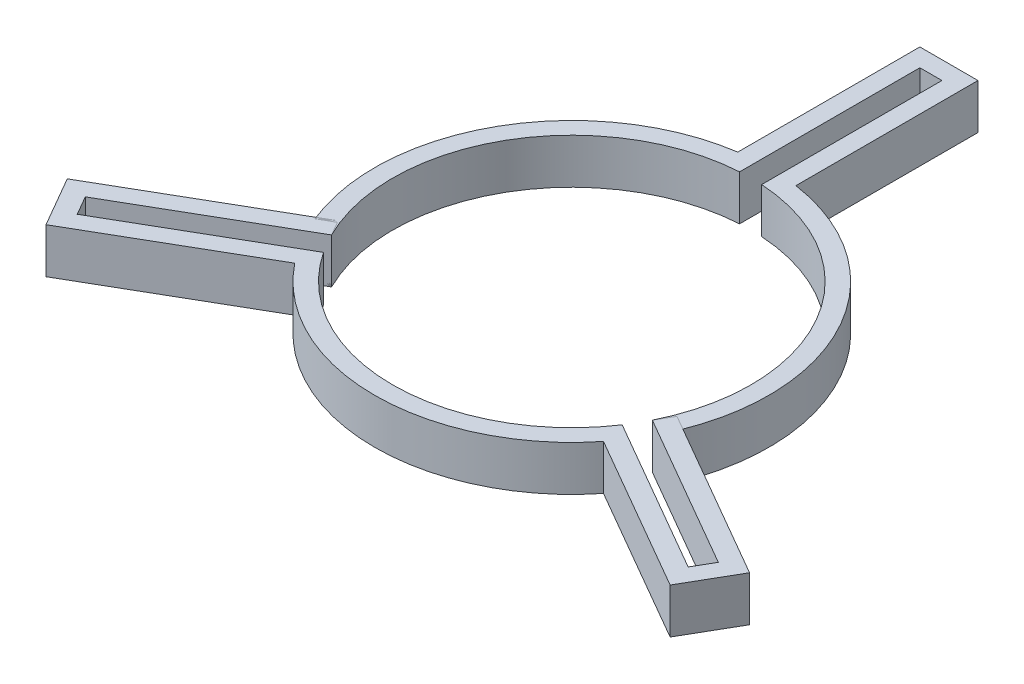
ISO-10303-21;
HEADER;
FILE_DESCRIPTION(('STEP AP214'),'2;1');
FILE_NAME('part.step','',(''),(''),'','','');
FILE_SCHEMA(('AUTOMOTIVE_DESIGN { 1 0 10303 214 1 1 1 1 }'));
ENDSEC;
DATA;
#1=APPLICATION_CONTEXT('core data for automotive mechanical design processes');
#2=APPLICATION_PROTOCOL_DEFINITION('international standard','automotive_design',2000,#1);
#3=PRODUCT_CONTEXT('',#1,'mechanical');
#4=PRODUCT('Part','Part','',(#3));
#5=PRODUCT_RELATED_PRODUCT_CATEGORY('part','',(#4));
#6=PRODUCT_DEFINITION_FORMATION('','',#4);
#7=PRODUCT_DEFINITION_CONTEXT('part definition',#1,'design');
#8=PRODUCT_DEFINITION('design','',#6,#7);
#9=PRODUCT_DEFINITION_SHAPE('','',#8);
#10=(LENGTH_UNIT() NAMED_UNIT(*) SI_UNIT(.MILLI.,.METRE.));
#11=(NAMED_UNIT(*) PLANE_ANGLE_UNIT() SI_UNIT($,.RADIAN.));
#12=(NAMED_UNIT(*) SI_UNIT($,.STERADIAN.) SOLID_ANGLE_UNIT());
#13=UNCERTAINTY_MEASURE_WITH_UNIT(LENGTH_MEASURE(1.E-05),#10,'distance_accuracy_value','');
#14=(GEOMETRIC_REPRESENTATION_CONTEXT(3) GLOBAL_UNCERTAINTY_ASSIGNED_CONTEXT((#13)) GLOBAL_UNIT_ASSIGNED_CONTEXT((#10,
#11,#12)) REPRESENTATION_CONTEXT('',''));
#15=CARTESIAN_POINT('',(0.,0.,0.));
#16=DIRECTION('',(0.,0.,1.));
#17=DIRECTION('',(1.,0.,0.));
#18=AXIS2_PLACEMENT_3D('',#15,#16,#17);
#19=CARTESIAN_POINT('',(0.,10.,0.));
#20=DIRECTION('',(0.,-1.,0.));
#21=DIRECTION('',(0.,0.,-1.));
#22=AXIS2_PLACEMENT_3D('',#19,#20,#21);
#23=CYLINDRICAL_SURFACE('',#22,43.75);
#24=CARTESIAN_POINT('',(0.,10.,0.));
#25=DIRECTION('',(0.,1.,0.));
#26=DIRECTION('',(0.,0.,1.));
#27=AXIS2_PLACEMENT_3D('',#24,#25,#26);
#28=CIRCLE('',#27,43.75);
#29=CARTESIAN_POINT('',(39.054155422769,10.,19.7189108272795));
#30=VERTEX_POINT('',#29);
#31=CARTESIAN_POINT('',(6.45,10.,-43.2719308559255));
#32=VERTEX_POINT('',#31);
#33=EDGE_CURVE('E185',#30,#32,#28,.T.);
#34=ORIENTED_EDGE('',*,*,#33,.F.);
#35=DIRECTION('',(0.,-1.,0.));
#36=VECTOR('',#35,1.);
#37=CARTESIAN_POINT('',(39.054155422769,10.,19.7189108272795));
#38=LINE('',#37,#36);
#39=CARTESIAN_POINT('',(39.054155422769,0.,19.7189108272795));
#40=VERTEX_POINT('',#39);
#41=EDGE_CURVE('E83',#30,#40,#38,.T.);
#42=ORIENTED_EDGE('',*,*,#41,.T.);
#43=CARTESIAN_POINT('',(0.,0.,0.));
#44=DIRECTION('',(0.,1.,0.));
#45=DIRECTION('',(0.,0.,1.));
#46=AXIS2_PLACEMENT_3D('',#43,#44,#45);
#47=CIRCLE('',#46,43.75);
#48=CARTESIAN_POINT('',(6.45,0.,-43.2719308559255));
#49=VERTEX_POINT('',#48);
#50=EDGE_CURVE('E176',#40,#49,#47,.T.);
#51=ORIENTED_EDGE('',*,*,#50,.T.);
#52=DIRECTION('',(0.,-1.,0.));
#53=VECTOR('',#52,1.);
#54=CARTESIAN_POINT('',(6.45,10.,-43.2719308559255));
#55=LINE('',#54,#53);
#56=EDGE_CURVE('E198',#49,#32,#55,.F.);
#57=ORIENTED_EDGE('',*,*,#56,.T.);
#58=EDGE_LOOP('',(#34,#42,#51,#57));
#59=FACE_BOUND('',#58,.T.);
#60=ADVANCED_FACE('F43',(#59),#23,.T.);
#61=CARTESIAN_POINT('',(0.,10.,0.));
#62=DIRECTION('',(0.,-1.,0.));
#63=DIRECTION('',(0.,0.,-1.));
#64=AXIS2_PLACEMENT_3D('',#61,#62,#63);
#65=CYLINDRICAL_SURFACE('',#64,39.75);
#66=DIRECTION('',(0.,-1.,0.));
#67=VECTOR('',#66,1.);
#68=CARTESIAN_POINT('',(35.5840599405748,10.,17.715450266521));
#69=LINE('',#68,#67);
#70=CARTESIAN_POINT('',(35.5840599405748,10.,17.715450266521));
#71=VERTEX_POINT('',#70);
#72=CARTESIAN_POINT('',(35.5840599405748,0.,17.715450266521));
#73=VERTEX_POINT('',#72);
#74=EDGE_CURVE('E178',#71,#73,#69,.T.);
#75=ORIENTED_EDGE('',*,*,#74,.F.);
#76=CARTESIAN_POINT('',(0.,10.,0.));
#77=DIRECTION('',(0.,1.,0.));
#78=DIRECTION('',(0.,0.,1.));
#79=AXIS2_PLACEMENT_3D('',#76,#77,#78);
#80=CIRCLE('',#79,39.75);
#81=CARTESIAN_POINT('',(2.45,10.,-39.6744250115865));
#82=VERTEX_POINT('',#81);
#83=EDGE_CURVE('E190',#71,#82,#80,.T.);
#84=ORIENTED_EDGE('',*,*,#83,.T.);
#85=DIRECTION('',(0.,-1.,0.));
#86=VECTOR('',#85,1.);
#87=CARTESIAN_POINT('',(2.45,10.,-39.6744250115865));
#88=LINE('',#87,#86);
#89=CARTESIAN_POINT('',(2.45,0.,-39.6744250115865));
#90=VERTEX_POINT('',#89);
#91=EDGE_CURVE('E189',#90,#82,#88,.F.);
#92=ORIENTED_EDGE('',*,*,#91,.F.);
#93=CARTESIAN_POINT('',(0.,0.,0.));
#94=DIRECTION('',(0.,1.,0.));
#95=DIRECTION('',(0.,0.,1.));
#96=AXIS2_PLACEMENT_3D('',#93,#94,#95);
#97=CIRCLE('',#96,39.75);
#98=EDGE_CURVE('E144',#73,#90,#97,.T.);
#99=ORIENTED_EDGE('',*,*,#98,.F.);
#100=EDGE_LOOP('',(#75,#84,#92,#99));
#101=FACE_BOUND('',#100,.T.);
#102=ADVANCED_FACE('F250',(#101),#65,.F.);
#103=CARTESIAN_POINT('',(0.,10.,0.));
#104=DIRECTION('',(0.,1.,0.));
#105=DIRECTION('',(0.,0.,1.));
#106=AXIS2_PLACEMENT_3D('',#103,#104,#105);
#107=PLANE('',#106);
#108=DIRECTION('',(-0.866025403784436,0.,0.500000000000004));
#109=VECTOR('',#108,1.);
#110=CARTESIAN_POINT('',(-44.628813186876,10.,22.9374409880275));
#111=LINE('',#110,#109);
#112=CARTESIAN_POINT('',(-35.5840599405745,10.,17.7154502665215));
#113=VERTEX_POINT('',#112);
#114=CARTESIAN_POINT('',(-39.0541554227687,10.,19.7189108272801));
#115=VERTEX_POINT('',#114);
#116=EDGE_CURVE('E12',#113,#115,#111,.T.);
#117=ORIENTED_EDGE('',*,*,#116,.F.);
#118=CARTESIAN_POINT('',(-2.45000000000001,10.,-39.6744250115865));
#119=VERTEX_POINT('',#118);
#120=EDGE_CURVE('E187',#119,#113,#80,.T.);
#121=ORIENTED_EDGE('',*,*,#120,.F.);
#122=DIRECTION('',(0.,0.,1.));
#123=VECTOR('',#122,1.);
#124=CARTESIAN_POINT('',(-2.45000000000001,10.,-37.8382708200077));
#125=LINE('',#124,#123);
#126=CARTESIAN_POINT('',(-2.45,10.,-79.6744250115865));
#127=VERTEX_POINT('',#126);
#128=EDGE_CURVE('E211',#127,#119,#125,.T.);
#129=ORIENTED_EDGE('',*,*,#128,.F.);
#130=DIRECTION('',(1.,0.,0.));
#131=VECTOR('',#130,1.);
#132=CARTESIAN_POINT('',(2.45,10.,-79.6744250115865));
#133=LINE('',#132,#131);
#134=CARTESIAN_POINT('',(2.45,10.,-79.6744250115865));
#135=VERTEX_POINT('',#134);
#136=EDGE_CURVE('E197',#127,#135,#133,.T.);
#137=ORIENTED_EDGE('',*,*,#136,.T.);
#138=DIRECTION('',(0.,0.,-1.));
#139=VECTOR('',#138,1.);
#140=CARTESIAN_POINT('',(2.44999999999999,10.,-50.1184064545983));
#141=LINE('',#140,#139);
#142=EDGE_CURVE('E154',#82,#135,#141,.T.);
#143=ORIENTED_EDGE('',*,*,#142,.F.);
#144=ORIENTED_EDGE('',*,*,#83,.F.);
#145=DIRECTION('',(-0.866025403784443,0.,-0.499999999999992));
#146=VECTOR('',#145,1.);
#147=CARTESIAN_POINT('',(33.9939037654022,10.,16.7973731707316));
#148=LINE('',#147,#146);
#149=EDGE_CURVE('E158',#30,#71,#148,.T.);
#150=ORIENTED_EDGE('',*,*,#149,.F.);
#151=ORIENTED_EDGE('',*,*,#33,.T.);
#152=DIRECTION('',(0.,0.,-1.));
#153=VECTOR('',#152,1.);
#154=CARTESIAN_POINT('',(6.44999999999999,10.,-83.6744250115865));
#155=LINE('',#154,#153);
#156=CARTESIAN_POINT('',(6.44999999999999,10.,-83.6744250115865));
#157=VERTEX_POINT('',#156);
#158=EDGE_CURVE('E225',#32,#157,#155,.T.);
#159=ORIENTED_EDGE('',*,*,#158,.T.);
#160=DIRECTION('',(-1.,0.,0.));
#161=VECTOR('',#160,1.);
#162=CARTESIAN_POINT('',(-6.45000000000001,10.,-83.6744250115865));
#163=LINE('',#162,#161);
#164=CARTESIAN_POINT('',(-6.45000000000001,10.,-83.6744250115865));
#165=VERTEX_POINT('',#164);
#166=EDGE_CURVE('E222',#157,#165,#163,.T.);
#167=ORIENTED_EDGE('',*,*,#166,.T.);
#168=DIRECTION('',(0.,0.,1.));
#169=VECTOR('',#168,1.);
#170=CARTESIAN_POINT('',(-6.45000000000001,10.,-39.6744250115865));
#171=LINE('',#170,#169);
#172=CARTESIAN_POINT('',(-6.45000000000001,10.,-43.2719308559255));
#173=VERTEX_POINT('',#172);
#174=EDGE_CURVE('E184',#165,#173,#171,.T.);
#175=ORIENTED_EDGE('',*,*,#174,.T.);
#176=EDGE_CURVE('E181',#173,#115,#28,.T.);
#177=ORIENTED_EDGE('',*,*,#176,.T.);
#178=EDGE_LOOP('',(#117,#121,#129,#137,#143,#144,#150,#151,#159,#167,#175,#177));
#179=FACE_BOUND('',#178,.T.);
#180=ADVANCED_FACE('F45',(#179),#107,.T.);
#181=CARTESIAN_POINT('',(0.,0.,0.));
#182=DIRECTION('',(0.,1.,0.));
#183=DIRECTION('',(0.,0.,1.));
#184=AXIS2_PLACEMENT_3D('',#181,#182,#183);
#185=PLANE('',#184);
#186=CARTESIAN_POINT('',(-2.45000000000001,0.,-39.6744250115865));
#187=VERTEX_POINT('',#186);
#188=CARTESIAN_POINT('',(-35.5840599405745,0.,17.7154502665215));
#189=VERTEX_POINT('',#188);
#190=EDGE_CURVE('E47',#187,#189,#97,.T.);
#191=ORIENTED_EDGE('',*,*,#190,.T.);
#192=DIRECTION('',(-0.866025403784436,0.,0.500000000000004));
#193=VECTOR('',#192,1.);
#194=CARTESIAN_POINT('',(-44.628813186876,0.,22.9374409880275));
#195=LINE('',#194,#193);
#196=CARTESIAN_POINT('',(-39.0541554227687,0.,19.7189108272801));
#197=VERTEX_POINT('',#196);
#198=EDGE_CURVE('E86',#189,#197,#195,.T.);
#199=ORIENTED_EDGE('',*,*,#198,.T.);
#200=CARTESIAN_POINT('',(-6.45000000000001,0.,-43.2719308559255));
#201=VERTEX_POINT('',#200);
#202=EDGE_CURVE('E174',#201,#197,#47,.T.);
#203=ORIENTED_EDGE('',*,*,#202,.F.);
#204=DIRECTION('',(0.,0.,1.));
#205=VECTOR('',#204,1.);
#206=CARTESIAN_POINT('',(-6.45000000000001,0.,-39.6744250115865));
#207=LINE('',#206,#205);
#208=CARTESIAN_POINT('',(-6.45000000000001,0.,-83.6744250115865));
#209=VERTEX_POINT('',#208);
#210=EDGE_CURVE('E216',#209,#201,#207,.T.);
#211=ORIENTED_EDGE('',*,*,#210,.F.);
#212=DIRECTION('',(-1.,0.,0.));
#213=VECTOR('',#212,1.);
#214=CARTESIAN_POINT('',(-6.45000000000001,0.,-83.6744250115865));
#215=LINE('',#214,#213);
#216=CARTESIAN_POINT('',(6.44999999999999,0.,-83.6744250115865));
#217=VERTEX_POINT('',#216);
#218=EDGE_CURVE('E166',#217,#209,#215,.T.);
#219=ORIENTED_EDGE('',*,*,#218,.F.);
#220=DIRECTION('',(0.,0.,-1.));
#221=VECTOR('',#220,1.);
#222=CARTESIAN_POINT('',(6.44999999999999,0.,-83.6744250115865));
#223=LINE('',#222,#221);
#224=EDGE_CURVE('E170',#49,#217,#223,.T.);
#225=ORIENTED_EDGE('',*,*,#224,.F.);
#226=ORIENTED_EDGE('',*,*,#50,.F.);
#227=DIRECTION('',(-0.866025403784443,0.,-0.499999999999992));
#228=VECTOR('',#227,1.);
#229=CARTESIAN_POINT('',(33.9939037654022,0.,16.7973731707316));
#230=LINE('',#229,#228);
#231=EDGE_CURVE('E80',#40,#73,#230,.T.);
#232=ORIENTED_EDGE('',*,*,#231,.T.);
#233=ORIENTED_EDGE('',*,*,#98,.T.);
#234=DIRECTION('',(0.,0.,-1.));
#235=VECTOR('',#234,1.);
#236=CARTESIAN_POINT('',(2.44999999999999,0.,-50.1184064545983));
#237=LINE('',#236,#235);
#238=CARTESIAN_POINT('',(2.45,0.,-79.6744250115865));
#239=VERTEX_POINT('',#238);
#240=EDGE_CURVE('E136',#90,#239,#237,.T.);
#241=ORIENTED_EDGE('',*,*,#240,.T.);
#242=DIRECTION('',(1.,0.,0.));
#243=VECTOR('',#242,1.);
#244=CARTESIAN_POINT('',(2.45,0.,-79.6744250115865));
#245=LINE('',#244,#243);
#246=CARTESIAN_POINT('',(-2.45,0.,-79.6744250115865));
#247=VERTEX_POINT('',#246);
#248=EDGE_CURVE('E142',#247,#239,#245,.T.);
#249=ORIENTED_EDGE('',*,*,#248,.F.);
#250=DIRECTION('',(0.,0.,1.));
#251=VECTOR('',#250,1.);
#252=CARTESIAN_POINT('',(-2.45000000000001,0.,-37.8382708200077));
#253=LINE('',#252,#251);
#254=EDGE_CURVE('E148',#247,#187,#253,.T.);
#255=ORIENTED_EDGE('',*,*,#254,.T.);
#256=EDGE_LOOP('',(#191,#199,#203,#211,#219,#225,#226,#232,#233,#241,#249,#255));
#257=FACE_BOUND('',#256,.T.);
#258=ADVANCED_FACE('F139',(#257),#185,.F.);
#259=ORIENTED_EDGE('',*,*,#202,.T.);
#260=DIRECTION('',(0.,-1.,0.));
#261=VECTOR('',#260,1.);
#262=CARTESIAN_POINT('',(-39.0541554227687,10.,19.7189108272801));
#263=LINE('',#262,#261);
#264=EDGE_CURVE('E61',#197,#115,#263,.F.);
#265=ORIENTED_EDGE('',*,*,#264,.T.);
#266=ORIENTED_EDGE('',*,*,#176,.F.);
#267=DIRECTION('',(0.,-1.,0.));
#268=VECTOR('',#267,1.);
#269=CARTESIAN_POINT('',(-6.45000000000001,10.,-43.2719308559255));
#270=LINE('',#269,#268);
#271=EDGE_CURVE('E173',#173,#201,#270,.T.);
#272=ORIENTED_EDGE('',*,*,#271,.T.);
#273=EDGE_LOOP('',(#259,#265,#266,#272));
#274=FACE_BOUND('',#273,.T.);
#275=ADVANCED_FACE('F242',(#274),#23,.T.);
#276=DIRECTION('',(0.,-1.,0.));
#277=VECTOR('',#276,1.);
#278=CARTESIAN_POINT('',(-35.5840599405745,10.,17.7154502665215));
#279=LINE('',#278,#277);
#280=EDGE_CURVE('E53',#189,#113,#279,.F.);
#281=ORIENTED_EDGE('',*,*,#280,.F.);
#282=ORIENTED_EDGE('',*,*,#190,.F.);
#283=DIRECTION('',(0.,-1.,0.));
#284=VECTOR('',#283,1.);
#285=CARTESIAN_POINT('',(-2.45000000000001,10.,-39.6744250115865));
#286=LINE('',#285,#284);
#287=EDGE_CURVE('E210',#119,#187,#286,.T.);
#288=ORIENTED_EDGE('',*,*,#287,.F.);
#289=ORIENTED_EDGE('',*,*,#120,.T.);
#290=EDGE_LOOP('',(#281,#282,#288,#289));
#291=FACE_BOUND('',#290,.T.);
#292=ADVANCED_FACE('F256',(#291),#65,.F.);
#293=CARTESIAN_POINT('',(2.44999999999999,0.,-50.1184064545983));
#294=DIRECTION('',(1.,0.,0.));
#295=DIRECTION('',(0.,0.,-1.));
#296=AXIS2_PLACEMENT_3D('',#293,#294,#295);
#297=PLANE('',#296);
#298=ORIENTED_EDGE('',*,*,#240,.F.);
#299=ORIENTED_EDGE('',*,*,#91,.T.);
#300=ORIENTED_EDGE('',*,*,#142,.T.);
#301=DIRECTION('',(0.,1.,0.));
#302=VECTOR('',#301,1.);
#303=CARTESIAN_POINT('',(2.45,0.,-79.6744250115865));
#304=LINE('',#303,#302);
#305=EDGE_CURVE('E151',#239,#135,#304,.T.);
#306=ORIENTED_EDGE('',*,*,#305,.F.);
#307=EDGE_LOOP('',(#298,#299,#300,#306));
#308=FACE_BOUND('',#307,.T.);
#309=ADVANCED_FACE('F152',(#308),#297,.F.);
#310=CARTESIAN_POINT('',(-2.45000000000001,0.,-37.8382708200077));
#311=DIRECTION('',(-1.,0.,0.));
#312=DIRECTION('',(0.,0.,1.));
#313=AXIS2_PLACEMENT_3D('',#310,#311,#312);
#314=PLANE('',#313);
#315=ORIENTED_EDGE('',*,*,#128,.T.);
#316=ORIENTED_EDGE('',*,*,#287,.T.);
#317=ORIENTED_EDGE('',*,*,#254,.F.);
#318=DIRECTION('',(0.,1.,0.));
#319=VECTOR('',#318,1.);
#320=CARTESIAN_POINT('',(-2.45,0.,-79.6744250115865));
#321=LINE('',#320,#319);
#322=EDGE_CURVE('E163',#247,#127,#321,.T.);
#323=ORIENTED_EDGE('',*,*,#322,.T.);
#324=EDGE_LOOP('',(#315,#316,#317,#323));
#325=FACE_BOUND('',#324,.T.);
#326=ADVANCED_FACE('F306',(#325),#314,.F.);
#327=CARTESIAN_POINT('',(-6.45000000000001,0.,-39.6744250115865));
#328=DIRECTION('',(-1.,0.,0.));
#329=DIRECTION('',(0.,0.,1.));
#330=AXIS2_PLACEMENT_3D('',#327,#328,#329);
#331=PLANE('',#330);
#332=ORIENTED_EDGE('',*,*,#271,.F.);
#333=ORIENTED_EDGE('',*,*,#174,.F.);
#334=DIRECTION('',(0.,1.,0.));
#335=VECTOR('',#334,1.);
#336=CARTESIAN_POINT('',(-6.45000000000001,0.,-83.6744250115865));
#337=LINE('',#336,#335);
#338=EDGE_CURVE('E164',#209,#165,#337,.T.);
#339=ORIENTED_EDGE('',*,*,#338,.F.);
#340=ORIENTED_EDGE('',*,*,#210,.T.);
#341=EDGE_LOOP('',(#332,#333,#339,#340));
#342=FACE_BOUND('',#341,.T.);
#343=ADVANCED_FACE('F238',(#342),#331,.T.);
#344=CARTESIAN_POINT('',(6.44999999999999,0.,-83.6744250115865));
#345=DIRECTION('',(1.,0.,0.));
#346=DIRECTION('',(0.,0.,-1.));
#347=AXIS2_PLACEMENT_3D('',#344,#345,#346);
#348=PLANE('',#347);
#349=ORIENTED_EDGE('',*,*,#56,.F.);
#350=ORIENTED_EDGE('',*,*,#224,.T.);
#351=DIRECTION('',(0.,1.,0.));
#352=VECTOR('',#351,1.);
#353=CARTESIAN_POINT('',(6.44999999999999,0.,-83.6744250115865));
#354=LINE('',#353,#352);
#355=EDGE_CURVE('E218',#217,#157,#354,.T.);
#356=ORIENTED_EDGE('',*,*,#355,.T.);
#357=ORIENTED_EDGE('',*,*,#158,.F.);
#358=EDGE_LOOP('',(#349,#350,#356,#357));
#359=FACE_BOUND('',#358,.T.);
#360=ADVANCED_FACE('F247',(#359),#348,.T.);
#361=CARTESIAN_POINT('',(-6.45000000000001,0.,-83.6744250115865));
#362=DIRECTION('',(0.,0.,-1.));
#363=DIRECTION('',(-1.,0.,0.));
#364=AXIS2_PLACEMENT_3D('',#361,#362,#363);
#365=PLANE('',#364);
#366=ORIENTED_EDGE('',*,*,#166,.F.);
#367=ORIENTED_EDGE('',*,*,#355,.F.);
#368=ORIENTED_EDGE('',*,*,#218,.T.);
#369=ORIENTED_EDGE('',*,*,#338,.T.);
#370=EDGE_LOOP('',(#366,#367,#368,#369));
#371=FACE_BOUND('',#370,.T.);
#372=ADVANCED_FACE('F233',(#371),#365,.T.);
#373=CARTESIAN_POINT('',(2.45,0.,-79.6744250115865));
#374=DIRECTION('',(0.,0.,1.));
#375=DIRECTION('',(1.,0.,0.));
#376=AXIS2_PLACEMENT_3D('',#373,#374,#375);
#377=PLANE('',#376);
#378=ORIENTED_EDGE('',*,*,#136,.F.);
#379=ORIENTED_EDGE('',*,*,#322,.F.);
#380=ORIENTED_EDGE('',*,*,#248,.T.);
#381=ORIENTED_EDGE('',*,*,#305,.T.);
#382=EDGE_LOOP('',(#378,#379,#380,#381));
#383=FACE_BOUND('',#382,.T.);
#384=ADVANCED_FACE('F161',(#383),#377,.T.);
#385=CARTESIAN_POINT('',(33.9939037654022,0.,16.7973731707316));
#386=DIRECTION('',(0.499999999999992,0.,-0.866025403784443));
#387=DIRECTION('',(-0.866025403784443,0.,-0.499999999999992));
#388=AXIS2_PLACEMENT_3D('',#385,#386,#387);
#389=PLANE('',#388);
#390=ORIENTED_EDGE('',*,*,#149,.T.);
#391=ORIENTED_EDGE('',*,*,#74,.T.);
#392=ORIENTED_EDGE('',*,*,#231,.F.);
#393=ORIENTED_EDGE('',*,*,#41,.F.);
#394=EDGE_LOOP('',(#390,#391,#392,#393));
#395=FACE_BOUND('',#394,.T.);
#396=ADVANCED_FACE('F350',(#395),#389,.F.);
#397=CARTESIAN_POINT('',(-44.628813186876,0.,22.9374409880275));
#398=DIRECTION('',(-0.500000000000004,0.,-0.866025403784436));
#399=DIRECTION('',(-0.866025403784436,0.,0.500000000000004));
#400=AXIS2_PLACEMENT_3D('',#397,#398,#399);
#401=PLANE('',#400);
#402=ORIENTED_EDGE('',*,*,#198,.F.);
#403=ORIENTED_EDGE('',*,*,#280,.T.);
#404=ORIENTED_EDGE('',*,*,#116,.T.);
#405=ORIENTED_EDGE('',*,*,#264,.F.);
#406=EDGE_LOOP('',(#402,#403,#404,#405));
#407=FACE_BOUND('',#406,.T.);
#408=ADVANCED_FACE('F359',(#407),#401,.F.);
#409=CLOSED_SHELL('',(#60,#102,#180,#258,#275,#292,#309,#326,#343,#360,#372,#384,#396,#408));
#410=MANIFOLD_SOLID_BREP('B2',#409);
#411=CARTESIAN_POINT('',(0.,10.,0.));
#412=DIRECTION('',(0.,-1.,0.));
#413=DIRECTION('',(0.,0.,-1.));
#414=AXIS2_PLACEMENT_3D('',#411,#412,#413);
#415=CYLINDRICAL_SURFACE('',#414,39.75);
#416=DIRECTION('',(0.,-1.,0.));
#417=VECTOR('',#416,1.);
#418=CARTESIAN_POINT('',(-33.1340599405745,10.,21.9589747450653));
#419=LINE('',#418,#417);
#420=CARTESIAN_POINT('',(-33.1340599405745,10.,21.9589747450653));
#421=VERTEX_POINT('',#420);
#422=CARTESIAN_POINT('',(-33.1340599405745,0.,21.9589747450653));
#423=VERTEX_POINT('',#422);
#424=EDGE_CURVE('E41',#421,#423,#419,.T.);
#425=ORIENTED_EDGE('',*,*,#424,.F.);
#426=CARTESIAN_POINT('',(0.,10.,0.));
#427=DIRECTION('',(0.,1.,0.));
#428=DIRECTION('',(0.,0.,1.));
#429=AXIS2_PLACEMENT_3D('',#426,#427,#428);
#430=CIRCLE('',#429,39.75);
#431=CARTESIAN_POINT('',(33.1340599405748,10.,21.9589747450648));
#432=VERTEX_POINT('',#431);
#433=EDGE_CURVE('E613',#421,#432,#430,.T.);
#434=ORIENTED_EDGE('',*,*,#433,.T.);
#435=DIRECTION('',(0.,-1.,0.));
#436=VECTOR('',#435,1.);
#437=CARTESIAN_POINT('',(33.1340599405748,10.,21.9589747450648));
#438=LINE('',#437,#436);
#439=CARTESIAN_POINT('',(33.1340599405748,0.,21.9589747450648));
#440=VERTEX_POINT('',#439);
#441=EDGE_CURVE('E389',#440,#432,#438,.F.);
#442=ORIENTED_EDGE('',*,*,#441,.F.);
#443=CARTESIAN_POINT('',(0.,0.,0.));
#444=DIRECTION('',(0.,1.,0.));
#445=DIRECTION('',(0.,0.,1.));
#446=AXIS2_PLACEMENT_3D('',#443,#444,#445);
#447=CIRCLE('',#446,39.75);
#448=EDGE_CURVE('E608',#423,#440,#447,.T.);
#449=ORIENTED_EDGE('',*,*,#448,.F.);
#450=EDGE_LOOP('',(#425,#434,#442,#449));
#451=FACE_BOUND('',#450,.T.);
#452=ADVANCED_FACE('F381',(#451),#415,.F.);
#453=CARTESIAN_POINT('',(0.,10.,0.));
#454=DIRECTION('',(0.,-1.,0.));
#455=DIRECTION('',(0.,0.,-1.));
#456=AXIS2_PLACEMENT_3D('',#453,#454,#455);
#457=CYLINDRICAL_SURFACE('',#456,43.75);
#458=CARTESIAN_POINT('',(0.,0.,0.));
#459=DIRECTION('',(0.,1.,0.));
#460=DIRECTION('',(0.,0.,1.));
#461=AXIS2_PLACEMENT_3D('',#458,#459,#460);
#462=CIRCLE('',#461,43.75);
#463=CARTESIAN_POINT('',(-34.2495913920351,0.,27.2218292823726));
#464=VERTEX_POINT('',#463);
#465=CARTESIAN_POINT('',(34.2495913920355,0.,27.2218292823721));
#466=VERTEX_POINT('',#465);
#467=EDGE_CURVE('E616',#464,#466,#462,.T.);
#468=ORIENTED_EDGE('',*,*,#467,.T.);
#469=DIRECTION('',(0.,-1.,0.));
#470=VECTOR('',#469,1.);
#471=CARTESIAN_POINT('',(34.2495913920355,10.,27.2218292823721));
#472=LINE('',#471,#470);
#473=CARTESIAN_POINT('',(34.2495913920355,10.,27.2218292823721));
#474=VERTEX_POINT('',#473);
#475=EDGE_CURVE('E544',#466,#474,#472,.F.);
#476=ORIENTED_EDGE('',*,*,#475,.T.);
#477=CARTESIAN_POINT('',(0.,10.,0.));
#478=DIRECTION('',(0.,1.,0.));
#479=DIRECTION('',(0.,0.,1.));
#480=AXIS2_PLACEMENT_3D('',#477,#478,#479);
#481=CIRCLE('',#480,43.75);
#482=CARTESIAN_POINT('',(-34.2495913920351,10.,27.2218292823726));
#483=VERTEX_POINT('',#482);
#484=EDGE_CURVE('E619',#483,#474,#481,.T.);
#485=ORIENTED_EDGE('',*,*,#484,.F.);
#486=DIRECTION('',(0.,-1.,0.));
#487=VECTOR('',#486,1.);
#488=CARTESIAN_POINT('',(-34.2495913920351,10.,27.2218292823726));
#489=LINE('',#488,#487);
#490=EDGE_CURVE('E591',#483,#464,#489,.T.);
#491=ORIENTED_EDGE('',*,*,#490,.T.);
#492=EDGE_LOOP('',(#468,#476,#485,#491));
#493=FACE_BOUND('',#492,.T.);
#494=ADVANCED_FACE('F383',(#493),#457,.T.);
#495=CARTESIAN_POINT('',(0.,0.,0.));
#496=DIRECTION('',(0.,1.,0.));
#497=DIRECTION('',(0.,0.,1.));
#498=AXIS2_PLACEMENT_3D('',#495,#496,#497);
#499=PLANE('',#498);
#500=DIRECTION('',(0.866025403784443,0.,0.499999999999992));
#501=VECTOR('',#500,1.);
#502=CARTESIAN_POINT('',(42.1788131868764,0.,27.1809654665706));
#503=LINE('',#502,#501);
#504=CARTESIAN_POINT('',(67.7750760919526,0.,41.9589747450645));
#505=VERTEX_POINT('',#504);
#506=EDGE_CURVE('E404',#440,#505,#503,.T.);
#507=ORIENTED_EDGE('',*,*,#506,.T.);
#508=DIRECTION('',(-0.499999999999992,0.,0.866025403784443));
#509=VECTOR('',#508,1.);
#510=CARTESIAN_POINT('',(67.7750760919526,0.,41.9589747450645));
#511=LINE('',#510,#509);
#512=CARTESIAN_POINT('',(70.2250760919525,0.,37.7154502665207));
#513=VERTEX_POINT('',#512);
#514=EDGE_CURVE('E516',#513,#505,#511,.T.);
#515=ORIENTED_EDGE('',*,*,#514,.F.);
#516=DIRECTION('',(0.866025403784443,0.,0.499999999999992));
#517=VECTOR('',#516,1.);
#518=CARTESIAN_POINT('',(35.5840599405748,0.,17.715450266521));
#519=LINE('',#518,#517);
#520=CARTESIAN_POINT('',(35.5840599405748,0.,17.715450266521));
#521=VERTEX_POINT('',#520);
#522=EDGE_CURVE('E498',#521,#513,#519,.T.);
#523=ORIENTED_EDGE('',*,*,#522,.F.);
#524=DIRECTION('',(-0.499999999999992,0.,0.866025403784443));
#525=VECTOR('',#524,1.);
#526=CARTESIAN_POINT('',(37.5840599405748,0.,14.2513486513833));
#527=LINE('',#526,#525);
#528=CARTESIAN_POINT('',(37.5840599405748,0.,14.2513486513833));
#529=VERTEX_POINT('',#528);
#530=EDGE_CURVE('E513',#529,#521,#527,.T.);
#531=ORIENTED_EDGE('',*,*,#530,.F.);
#532=DIRECTION('',(-0.866025403784443,0.,-0.499999999999992));
#533=VECTOR('',#532,1.);
#534=CARTESIAN_POINT('',(37.5840599405748,0.,14.2513486513833));
#535=LINE('',#534,#533);
#536=CARTESIAN_POINT('',(75.6891777070903,0.,36.2513486513829));
#537=VERTEX_POINT('',#536);
#538=EDGE_CURVE('E506',#537,#529,#535,.T.);
#539=ORIENTED_EDGE('',*,*,#538,.F.);
#540=DIRECTION('',(0.499999999999992,0.,-0.866025403784443));
#541=VECTOR('',#540,1.);
#542=CARTESIAN_POINT('',(75.6891777070903,0.,36.2513486513829));
#543=LINE('',#542,#541);
#544=CARTESIAN_POINT('',(69.2391777070904,0.,47.4230763602022));
#545=VERTEX_POINT('',#544);
#546=EDGE_CURVE('E529',#545,#537,#543,.T.);
#547=ORIENTED_EDGE('',*,*,#546,.F.);
#548=DIRECTION('',(0.866025403784443,0.,0.499999999999992));
#549=VECTOR('',#548,1.);
#550=CARTESIAN_POINT('',(69.2391777070904,0.,47.4230763602022));
#551=LINE('',#550,#549);
#552=EDGE_CURVE('E527',#466,#545,#551,.T.);
#553=ORIENTED_EDGE('',*,*,#552,.F.);
#554=ORIENTED_EDGE('',*,*,#467,.F.);
#555=DIRECTION('',(0.866025403784436,0.,-0.500000000000004));
#556=VECTOR('',#555,1.);
#557=CARTESIAN_POINT('',(-31.1340599405745,0.,25.423076360203));
#558=LINE('',#557,#556);
#559=CARTESIAN_POINT('',(-69.2391777070897,0.,47.4230763602032));
#560=VERTEX_POINT('',#559);
#561=EDGE_CURVE('E572',#560,#464,#558,.T.);
#562=ORIENTED_EDGE('',*,*,#561,.F.);
#563=DIRECTION('',(0.500000000000004,0.,0.866025403784436));
#564=VECTOR('',#563,1.);
#565=CARTESIAN_POINT('',(-69.2391777070897,0.,47.4230763602032));
#566=LINE('',#565,#564);
#567=CARTESIAN_POINT('',(-75.6891777070898,0.,36.251348651384));
#568=VERTEX_POINT('',#567);
#569=EDGE_CURVE('E569',#568,#560,#566,.T.);
#570=ORIENTED_EDGE('',*,*,#569,.F.);
#571=DIRECTION('',(-0.866025403784436,0.,0.500000000000004));
#572=VECTOR('',#571,1.);
#573=CARTESIAN_POINT('',(-75.6891777070898,0.,36.251348651384));
#574=LINE('',#573,#572);
#575=CARTESIAN_POINT('',(-37.5840599405746,0.,14.2513486513838));
#576=VERTEX_POINT('',#575);
#577=EDGE_CURVE('E566',#576,#568,#574,.T.);
#578=ORIENTED_EDGE('',*,*,#577,.F.);
#579=DIRECTION('',(-0.500000000000004,0.,-0.866025403784436));
#580=VECTOR('',#579,1.);
#581=CARTESIAN_POINT('',(-35.5840599405745,0.,17.7154502665215));
#582=LINE('',#581,#580);
#583=CARTESIAN_POINT('',(-35.5840599405745,0.,17.7154502665215));
#584=VERTEX_POINT('',#583);
#585=EDGE_CURVE('E563',#584,#576,#582,.T.);
#586=ORIENTED_EDGE('',*,*,#585,.F.);
#587=DIRECTION('',(0.866025403784436,0.,-0.500000000000004));
#588=VECTOR('',#587,1.);
#589=CARTESIAN_POINT('',(-35.5840599405745,0.,17.7154502665215));
#590=LINE('',#589,#588);
#591=CARTESIAN_POINT('',(-70.225076091952,0.,37.7154502665217));
#592=VERTEX_POINT('',#591);
#593=EDGE_CURVE('E560',#592,#584,#590,.T.);
#594=ORIENTED_EDGE('',*,*,#593,.F.);
#595=DIRECTION('',(-0.500000000000004,0.,-0.866025403784436));
#596=VECTOR('',#595,1.);
#597=CARTESIAN_POINT('',(-70.225076091952,0.,37.7154502665217));
#598=LINE('',#597,#596);
#599=CARTESIAN_POINT('',(-67.775076091952,0.,41.9589747450654));
#600=VERTEX_POINT('',#599);
#601=EDGE_CURVE('E557',#600,#592,#598,.T.);
#602=ORIENTED_EDGE('',*,*,#601,.F.);
#603=DIRECTION('',(0.866025403784436,0.,-0.500000000000004));
#604=VECTOR('',#603,1.);
#605=CARTESIAN_POINT('',(-31.543903765402,0.,21.0408976492759));
#606=LINE('',#605,#604);
#607=EDGE_CURVE('E605',#600,#423,#606,.T.);
#608=ORIENTED_EDGE('',*,*,#607,.T.);
#609=ORIENTED_EDGE('',*,*,#448,.T.);
#610=EDGE_LOOP('',(#507,#515,#523,#531,#539,#547,#553,#554,#562,#570,#578,#586,#594,#602,#608,#609));
#611=FACE_BOUND('',#610,.T.);
#612=ADVANCED_FACE('F511',(#611),#499,.F.);
#613=CARTESIAN_POINT('',(0.,10.,0.));
#614=DIRECTION('',(0.,1.,0.));
#615=DIRECTION('',(0.,0.,1.));
#616=AXIS2_PLACEMENT_3D('',#613,#614,#615);
#617=PLANE('',#616);
#618=ORIENTED_EDGE('',*,*,#484,.T.);
#619=DIRECTION('',(0.866025403784443,0.,0.499999999999992));
#620=VECTOR('',#619,1.);
#621=CARTESIAN_POINT('',(69.2391777070904,10.,47.4230763602022));
#622=LINE('',#621,#620);
#623=CARTESIAN_POINT('',(69.2391777070904,10.,47.4230763602022));
#624=VERTEX_POINT('',#623);
#625=EDGE_CURVE('E539',#474,#624,#622,.T.);
#626=ORIENTED_EDGE('',*,*,#625,.T.);
#627=DIRECTION('',(0.499999999999992,0.,-0.866025403784443));
#628=VECTOR('',#627,1.);
#629=CARTESIAN_POINT('',(75.6891777070903,10.,36.2513486513829));
#630=LINE('',#629,#628);
#631=CARTESIAN_POINT('',(75.6891777070903,10.,36.2513486513829));
#632=VERTEX_POINT('',#631);
#633=EDGE_CURVE('E523',#624,#632,#630,.T.);
#634=ORIENTED_EDGE('',*,*,#633,.T.);
#635=DIRECTION('',(-0.866025403784443,0.,-0.499999999999992));
#636=VECTOR('',#635,1.);
#637=CARTESIAN_POINT('',(37.5840599405748,10.,14.2513486513833));
#638=LINE('',#637,#636);
#639=CARTESIAN_POINT('',(37.5840599405748,10.,14.2513486513833));
#640=VERTEX_POINT('',#639);
#641=EDGE_CURVE('E520',#632,#640,#638,.T.);
#642=ORIENTED_EDGE('',*,*,#641,.T.);
#643=DIRECTION('',(-0.499999999999992,0.,0.866025403784443));
#644=VECTOR('',#643,1.);
#645=CARTESIAN_POINT('',(37.5840599405748,10.,14.2513486513833));
#646=LINE('',#645,#644);
#647=CARTESIAN_POINT('',(35.5840599405748,10.,17.715450266521));
#648=VERTEX_POINT('',#647);
#649=EDGE_CURVE('E533',#640,#648,#646,.T.);
#650=ORIENTED_EDGE('',*,*,#649,.T.);
#651=DIRECTION('',(0.866025403784443,0.,0.499999999999992));
#652=VECTOR('',#651,1.);
#653=CARTESIAN_POINT('',(35.5840599405748,10.,17.715450266521));
#654=LINE('',#653,#652);
#655=CARTESIAN_POINT('',(70.2250760919525,10.,37.7154502665207));
#656=VERTEX_POINT('',#655);
#657=EDGE_CURVE('E500',#648,#656,#654,.T.);
#658=ORIENTED_EDGE('',*,*,#657,.T.);
#659=DIRECTION('',(-0.499999999999992,0.,0.866025403784443));
#660=VECTOR('',#659,1.);
#661=CARTESIAN_POINT('',(67.7750760919526,10.,41.9589747450645));
#662=LINE('',#661,#660);
#663=CARTESIAN_POINT('',(67.7750760919526,10.,41.9589747450645));
#664=VERTEX_POINT('',#663);
#665=EDGE_CURVE('E536',#656,#664,#662,.T.);
#666=ORIENTED_EDGE('',*,*,#665,.T.);
#667=DIRECTION('',(0.866025403784443,0.,0.499999999999992));
#668=VECTOR('',#667,1.);
#669=CARTESIAN_POINT('',(42.1788131868764,10.,27.1809654665706));
#670=LINE('',#669,#668);
#671=EDGE_CURVE('E604',#432,#664,#670,.T.);
#672=ORIENTED_EDGE('',*,*,#671,.F.);
#673=ORIENTED_EDGE('',*,*,#433,.F.);
#674=DIRECTION('',(0.866025403784436,0.,-0.500000000000004));
#675=VECTOR('',#674,1.);
#676=CARTESIAN_POINT('',(-31.543903765402,10.,21.0408976492759));
#677=LINE('',#676,#675);
#678=CARTESIAN_POINT('',(-67.775076091952,10.,41.9589747450654));
#679=VERTEX_POINT('',#678);
#680=EDGE_CURVE('E609',#679,#421,#677,.T.);
#681=ORIENTED_EDGE('',*,*,#680,.F.);
#682=DIRECTION('',(-0.500000000000004,0.,-0.866025403784436));
#683=VECTOR('',#682,1.);
#684=CARTESIAN_POINT('',(-70.225076091952,10.,37.7154502665217));
#685=LINE('',#684,#683);
#686=CARTESIAN_POINT('',(-70.225076091952,10.,37.7154502665217));
#687=VERTEX_POINT('',#686);
#688=EDGE_CURVE('E556',#679,#687,#685,.T.);
#689=ORIENTED_EDGE('',*,*,#688,.T.);
#690=DIRECTION('',(0.866025403784436,0.,-0.500000000000004));
#691=VECTOR('',#690,1.);
#692=CARTESIAN_POINT('',(-35.5840599405745,10.,17.7154502665215));
#693=LINE('',#692,#691);
#694=CARTESIAN_POINT('',(-35.5840599405745,10.,17.7154502665215));
#695=VERTEX_POINT('',#694);
#696=EDGE_CURVE('E577',#687,#695,#693,.T.);
#697=ORIENTED_EDGE('',*,*,#696,.T.);
#698=DIRECTION('',(-0.500000000000004,0.,-0.866025403784436));
#699=VECTOR('',#698,1.);
#700=CARTESIAN_POINT('',(-35.5840599405745,10.,17.7154502665215));
#701=LINE('',#700,#699);
#702=CARTESIAN_POINT('',(-37.5840599405746,10.,14.2513486513838));
#703=VERTEX_POINT('',#702);
#704=EDGE_CURVE('E580',#695,#703,#701,.T.);
#705=ORIENTED_EDGE('',*,*,#704,.T.);
#706=DIRECTION('',(-0.866025403784436,0.,0.500000000000004));
#707=VECTOR('',#706,1.);
#708=CARTESIAN_POINT('',(-75.6891777070898,10.,36.251348651384));
#709=LINE('',#708,#707);
#710=CARTESIAN_POINT('',(-75.6891777070898,10.,36.251348651384));
#711=VERTEX_POINT('',#710);
#712=EDGE_CURVE('E583',#703,#711,#709,.T.);
#713=ORIENTED_EDGE('',*,*,#712,.T.);
#714=DIRECTION('',(0.500000000000004,0.,0.866025403784436));
#715=VECTOR('',#714,1.);
#716=CARTESIAN_POINT('',(-69.2391777070897,10.,47.4230763602032));
#717=LINE('',#716,#715);
#718=CARTESIAN_POINT('',(-69.2391777070897,10.,47.4230763602032));
#719=VERTEX_POINT('',#718);
#720=EDGE_CURVE('E586',#711,#719,#717,.T.);
#721=ORIENTED_EDGE('',*,*,#720,.T.);
#722=DIRECTION('',(0.866025403784436,0.,-0.500000000000004));
#723=VECTOR('',#722,1.);
#724=CARTESIAN_POINT('',(-31.1340599405745,10.,25.423076360203));
#725=LINE('',#724,#723);
#726=EDGE_CURVE('E396',#719,#483,#725,.T.);
#727=ORIENTED_EDGE('',*,*,#726,.T.);
#728=EDGE_LOOP('',(#618,#626,#634,#642,#650,#658,#666,#672,#673,#681,#689,#697,#705,#713,#721,#727));
#729=FACE_BOUND('',#728,.T.);
#730=ADVANCED_FACE('F627',(#729),#617,.T.);
#731=CARTESIAN_POINT('',(42.1788131868764,0.,27.1809654665706));
#732=DIRECTION('',(-0.499999999999992,0.,0.866025403784443));
#733=DIRECTION('',(0.866025403784443,0.,0.499999999999992));
#734=AXIS2_PLACEMENT_3D('',#731,#732,#733);
#735=PLANE('',#734);
#736=ORIENTED_EDGE('',*,*,#506,.F.);
#737=ORIENTED_EDGE('',*,*,#441,.T.);
#738=ORIENTED_EDGE('',*,*,#671,.T.);
#739=DIRECTION('',(0.,1.,0.));
#740=VECTOR('',#739,1.);
#741=CARTESIAN_POINT('',(67.7750760919526,0.,41.9589747450645));
#742=LINE('',#741,#740);
#743=EDGE_CURVE('E550',#505,#664,#742,.T.);
#744=ORIENTED_EDGE('',*,*,#743,.F.);
#745=EDGE_LOOP('',(#736,#737,#738,#744));
#746=FACE_BOUND('',#745,.T.);
#747=ADVANCED_FACE('F623',(#746),#735,.F.);
#748=CARTESIAN_POINT('',(-31.543903765402,0.,21.0408976492759));
#749=DIRECTION('',(0.500000000000004,0.,0.866025403784436));
#750=DIRECTION('',(0.866025403784436,0.,-0.500000000000004));
#751=AXIS2_PLACEMENT_3D('',#748,#749,#750);
#752=PLANE('',#751);
#753=ORIENTED_EDGE('',*,*,#680,.T.);
#754=ORIENTED_EDGE('',*,*,#424,.T.);
#755=ORIENTED_EDGE('',*,*,#607,.F.);
#756=DIRECTION('',(0.,1.,0.));
#757=VECTOR('',#756,1.);
#758=CARTESIAN_POINT('',(-67.775076091952,0.,41.9589747450654));
#759=LINE('',#758,#757);
#760=EDGE_CURVE('E574',#600,#679,#759,.T.);
#761=ORIENTED_EDGE('',*,*,#760,.T.);
#762=EDGE_LOOP('',(#753,#754,#755,#761));
#763=FACE_BOUND('',#762,.T.);
#764=ADVANCED_FACE('F631',(#763),#752,.F.);
#765=CARTESIAN_POINT('',(-31.1340599405745,0.,25.423076360203));
#766=DIRECTION('',(0.500000000000004,0.,0.866025403784436));
#767=DIRECTION('',(0.866025403784436,0.,-0.500000000000004));
#768=AXIS2_PLACEMENT_3D('',#765,#766,#767);
#769=PLANE('',#768);
#770=ORIENTED_EDGE('',*,*,#490,.F.);
#771=ORIENTED_EDGE('',*,*,#726,.F.);
#772=DIRECTION('',(0.,1.,0.));
#773=VECTOR('',#772,1.);
#774=CARTESIAN_POINT('',(-69.2391777070897,0.,47.4230763602032));
#775=LINE('',#774,#773);
#776=EDGE_CURVE('E589',#560,#719,#775,.T.);
#777=ORIENTED_EDGE('',*,*,#776,.F.);
#778=ORIENTED_EDGE('',*,*,#561,.T.);
#779=EDGE_LOOP('',(#770,#771,#777,#778));
#780=FACE_BOUND('',#779,.T.);
#781=ADVANCED_FACE('F652',(#780),#769,.T.);
#782=CARTESIAN_POINT('',(-69.2391777070897,0.,47.4230763602032));
#783=DIRECTION('',(-0.866025403784436,0.,0.500000000000004));
#784=DIRECTION('',(0.500000000000004,0.,0.866025403784436));
#785=AXIS2_PLACEMENT_3D('',#782,#783,#784);
#786=PLANE('',#785);
#787=ORIENTED_EDGE('',*,*,#720,.F.);
#788=DIRECTION('',(0.,1.,0.));
#789=VECTOR('',#788,1.);
#790=CARTESIAN_POINT('',(-75.6891777070898,0.,36.251348651384));
#791=LINE('',#790,#789);
#792=EDGE_CURVE('E592',#568,#711,#791,.T.);
#793=ORIENTED_EDGE('',*,*,#792,.F.);
#794=ORIENTED_EDGE('',*,*,#569,.T.);
#795=ORIENTED_EDGE('',*,*,#776,.T.);
#796=EDGE_LOOP('',(#787,#793,#794,#795));
#797=FACE_BOUND('',#796,.T.);
#798=ADVANCED_FACE('F669',(#797),#786,.T.);
#799=CARTESIAN_POINT('',(-75.6891777070898,0.,36.251348651384));
#800=DIRECTION('',(-0.500000000000004,0.,-0.866025403784436));
#801=DIRECTION('',(-0.866025403784436,0.,0.500000000000004));
#802=AXIS2_PLACEMENT_3D('',#799,#800,#801);
#803=PLANE('',#802);
#804=ORIENTED_EDGE('',*,*,#712,.F.);
#805=DIRECTION('',(0.,1.,0.));
#806=VECTOR('',#805,1.);
#807=CARTESIAN_POINT('',(-37.5840599405746,0.,14.2513486513838));
#808=LINE('',#807,#806);
#809=EDGE_CURVE('E594',#576,#703,#808,.T.);
#810=ORIENTED_EDGE('',*,*,#809,.F.);
#811=ORIENTED_EDGE('',*,*,#577,.T.);
#812=ORIENTED_EDGE('',*,*,#792,.T.);
#813=EDGE_LOOP('',(#804,#810,#811,#812));
#814=FACE_BOUND('',#813,.T.);
#815=ADVANCED_FACE('F648',(#814),#803,.T.);
#816=CARTESIAN_POINT('',(-35.5840599405745,0.,17.7154502665215));
#817=DIRECTION('',(0.866025403784436,0.,-0.500000000000004));
#818=DIRECTION('',(-0.500000000000004,0.,-0.866025403784436));
#819=AXIS2_PLACEMENT_3D('',#816,#817,#818);
#820=PLANE('',#819);
#821=ORIENTED_EDGE('',*,*,#704,.F.);
#822=DIRECTION('',(0.,1.,0.));
#823=VECTOR('',#822,1.);
#824=CARTESIAN_POINT('',(-35.5840599405745,0.,17.7154502665215));
#825=LINE('',#824,#823);
#826=EDGE_CURVE('E596',#584,#695,#825,.T.);
#827=ORIENTED_EDGE('',*,*,#826,.F.);
#828=ORIENTED_EDGE('',*,*,#585,.T.);
#829=ORIENTED_EDGE('',*,*,#809,.T.);
#830=EDGE_LOOP('',(#821,#827,#828,#829));
#831=FACE_BOUND('',#830,.T.);
#832=ADVANCED_FACE('F644',(#831),#820,.T.);
#833=CARTESIAN_POINT('',(-35.5840599405745,0.,17.7154502665215));
#834=DIRECTION('',(0.500000000000004,0.,0.866025403784436));
#835=DIRECTION('',(0.866025403784436,0.,-0.500000000000004));
#836=AXIS2_PLACEMENT_3D('',#833,#834,#835);
#837=PLANE('',#836);
#838=ORIENTED_EDGE('',*,*,#696,.F.);
#839=DIRECTION('',(0.,1.,0.));
#840=VECTOR('',#839,1.);
#841=CARTESIAN_POINT('',(-70.225076091952,0.,37.7154502665217));
#842=LINE('',#841,#840);
#843=EDGE_CURVE('E598',#592,#687,#842,.T.);
#844=ORIENTED_EDGE('',*,*,#843,.F.);
#845=ORIENTED_EDGE('',*,*,#593,.T.);
#846=ORIENTED_EDGE('',*,*,#826,.T.);
#847=EDGE_LOOP('',(#838,#844,#845,#846));
#848=FACE_BOUND('',#847,.T.);
#849=ADVANCED_FACE('F642',(#848),#837,.T.);
#850=CARTESIAN_POINT('',(-70.225076091952,0.,37.7154502665217));
#851=DIRECTION('',(0.866025403784436,0.,-0.500000000000004));
#852=DIRECTION('',(-0.500000000000004,0.,-0.866025403784436));
#853=AXIS2_PLACEMENT_3D('',#850,#851,#852);
#854=PLANE('',#853);
#855=ORIENTED_EDGE('',*,*,#688,.F.);
#856=ORIENTED_EDGE('',*,*,#760,.F.);
#857=ORIENTED_EDGE('',*,*,#601,.T.);
#858=ORIENTED_EDGE('',*,*,#843,.T.);
#859=EDGE_LOOP('',(#855,#856,#857,#858));
#860=FACE_BOUND('',#859,.T.);
#861=ADVANCED_FACE('F638',(#860),#854,.T.);
#862=CARTESIAN_POINT('',(69.2391777070904,0.,47.4230763602022));
#863=DIRECTION('',(-0.499999999999992,0.,0.866025403784443));
#864=DIRECTION('',(0.866025403784443,0.,0.499999999999992));
#865=AXIS2_PLACEMENT_3D('',#862,#863,#864);
#866=PLANE('',#865);
#867=ORIENTED_EDGE('',*,*,#475,.F.);
#868=ORIENTED_EDGE('',*,*,#552,.T.);
#869=DIRECTION('',(0.,1.,0.));
#870=VECTOR('',#869,1.);
#871=CARTESIAN_POINT('',(69.2391777070904,0.,47.4230763602022));
#872=LINE('',#871,#870);
#873=EDGE_CURVE('E547',#545,#624,#872,.T.);
#874=ORIENTED_EDGE('',*,*,#873,.T.);
#875=ORIENTED_EDGE('',*,*,#625,.F.);
#876=EDGE_LOOP('',(#867,#868,#874,#875));
#877=FACE_BOUND('',#876,.T.);
#878=ADVANCED_FACE('F661',(#877),#866,.T.);
#879=CARTESIAN_POINT('',(37.5840599405748,0.,14.2513486513833));
#880=DIRECTION('',(-0.866025403784443,0.,-0.499999999999992));
#881=DIRECTION('',(-0.499999999999992,0.,0.866025403784443));
#882=AXIS2_PLACEMENT_3D('',#879,#880,#881);
#883=PLANE('',#882);
#884=ORIENTED_EDGE('',*,*,#649,.F.);
#885=DIRECTION('',(0.,1.,0.));
#886=VECTOR('',#885,1.);
#887=CARTESIAN_POINT('',(37.5840599405748,0.,14.2513486513833));
#888=LINE('',#887,#886);
#889=EDGE_CURVE('E519',#529,#640,#888,.T.);
#890=ORIENTED_EDGE('',*,*,#889,.F.);
#891=ORIENTED_EDGE('',*,*,#530,.T.);
#892=DIRECTION('',(0.,1.,0.));
#893=VECTOR('',#892,1.);
#894=CARTESIAN_POINT('',(35.5840599405748,0.,17.715450266521));
#895=LINE('',#894,#893);
#896=EDGE_CURVE('E495',#521,#648,#895,.T.);
#897=ORIENTED_EDGE('',*,*,#896,.T.);
#898=EDGE_LOOP('',(#884,#890,#891,#897));
#899=FACE_BOUND('',#898,.T.);
#900=ADVANCED_FACE('F518',(#899),#883,.T.);
#901=CARTESIAN_POINT('',(37.5840599405748,0.,14.2513486513833));
#902=DIRECTION('',(0.499999999999992,0.,-0.866025403784443));
#903=DIRECTION('',(-0.866025403784443,0.,-0.499999999999992));
#904=AXIS2_PLACEMENT_3D('',#901,#902,#903);
#905=PLANE('',#904);
#906=ORIENTED_EDGE('',*,*,#641,.F.);
#907=DIRECTION('',(0.,1.,0.));
#908=VECTOR('',#907,1.);
#909=CARTESIAN_POINT('',(75.6891777070903,0.,36.2513486513829));
#910=LINE('',#909,#908);
#911=EDGE_CURVE('E545',#537,#632,#910,.T.);
#912=ORIENTED_EDGE('',*,*,#911,.F.);
#913=ORIENTED_EDGE('',*,*,#538,.T.);
#914=ORIENTED_EDGE('',*,*,#889,.T.);
#915=EDGE_LOOP('',(#906,#912,#913,#914));
#916=FACE_BOUND('',#915,.T.);
#917=ADVANCED_FACE('F667',(#916),#905,.T.);
#918=CARTESIAN_POINT('',(75.6891777070903,0.,36.2513486513829));
#919=DIRECTION('',(0.866025403784443,0.,0.499999999999992));
#920=DIRECTION('',(0.499999999999992,0.,-0.866025403784443));
#921=AXIS2_PLACEMENT_3D('',#918,#919,#920);
#922=PLANE('',#921);
#923=ORIENTED_EDGE('',*,*,#633,.F.);
#924=ORIENTED_EDGE('',*,*,#873,.F.);
#925=ORIENTED_EDGE('',*,*,#546,.T.);
#926=ORIENTED_EDGE('',*,*,#911,.T.);
#927=EDGE_LOOP('',(#923,#924,#925,#926));
#928=FACE_BOUND('',#927,.T.);
#929=ADVANCED_FACE('F665',(#928),#922,.T.);
#930=CARTESIAN_POINT('',(67.7750760919526,0.,41.9589747450645));
#931=DIRECTION('',(-0.866025403784443,0.,-0.499999999999992));
#932=DIRECTION('',(-0.499999999999992,0.,0.866025403784443));
#933=AXIS2_PLACEMENT_3D('',#930,#931,#932);
#934=PLANE('',#933);
#935=ORIENTED_EDGE('',*,*,#665,.F.);
#936=DIRECTION('',(0.,1.,0.));
#937=VECTOR('',#936,1.);
#938=CARTESIAN_POINT('',(70.2250760919525,0.,37.7154502665207));
#939=LINE('',#938,#937);
#940=EDGE_CURVE('E505',#513,#656,#939,.T.);
#941=ORIENTED_EDGE('',*,*,#940,.F.);
#942=ORIENTED_EDGE('',*,*,#514,.T.);
#943=ORIENTED_EDGE('',*,*,#743,.T.);
#944=EDGE_LOOP('',(#935,#941,#942,#943));
#945=FACE_BOUND('',#944,.T.);
#946=ADVANCED_FACE('F777',(#945),#934,.T.);
#947=CARTESIAN_POINT('',(35.5840599405748,0.,17.715450266521));
#948=DIRECTION('',(-0.499999999999992,0.,0.866025403784443));
#949=DIRECTION('',(0.866025403784443,0.,0.499999999999992));
#950=AXIS2_PLACEMENT_3D('',#947,#948,#949);
#951=PLANE('',#950);
#952=ORIENTED_EDGE('',*,*,#657,.F.);
#953=ORIENTED_EDGE('',*,*,#896,.F.);
#954=ORIENTED_EDGE('',*,*,#522,.T.);
#955=ORIENTED_EDGE('',*,*,#940,.T.);
#956=EDGE_LOOP('',(#952,#953,#954,#955));
#957=FACE_BOUND('',#956,.T.);
#958=ADVANCED_FACE('F497',(#957),#951,.T.);
#959=CLOSED_SHELL('',(#452,#494,#612,#730,#747,#764,#781,#798,#815,#832,#849,#861,#878,#900,
#917,#929,#946,#958));
#960=MANIFOLD_SOLID_BREP('B6',#959);
#961=ADVANCED_BREP_SHAPE_REPRESENTATION('',(#18,#410,#960),#14);
#962=SHAPE_DEFINITION_REPRESENTATION(#9,#961);
ENDSEC;
END-ISO-10303-21;
